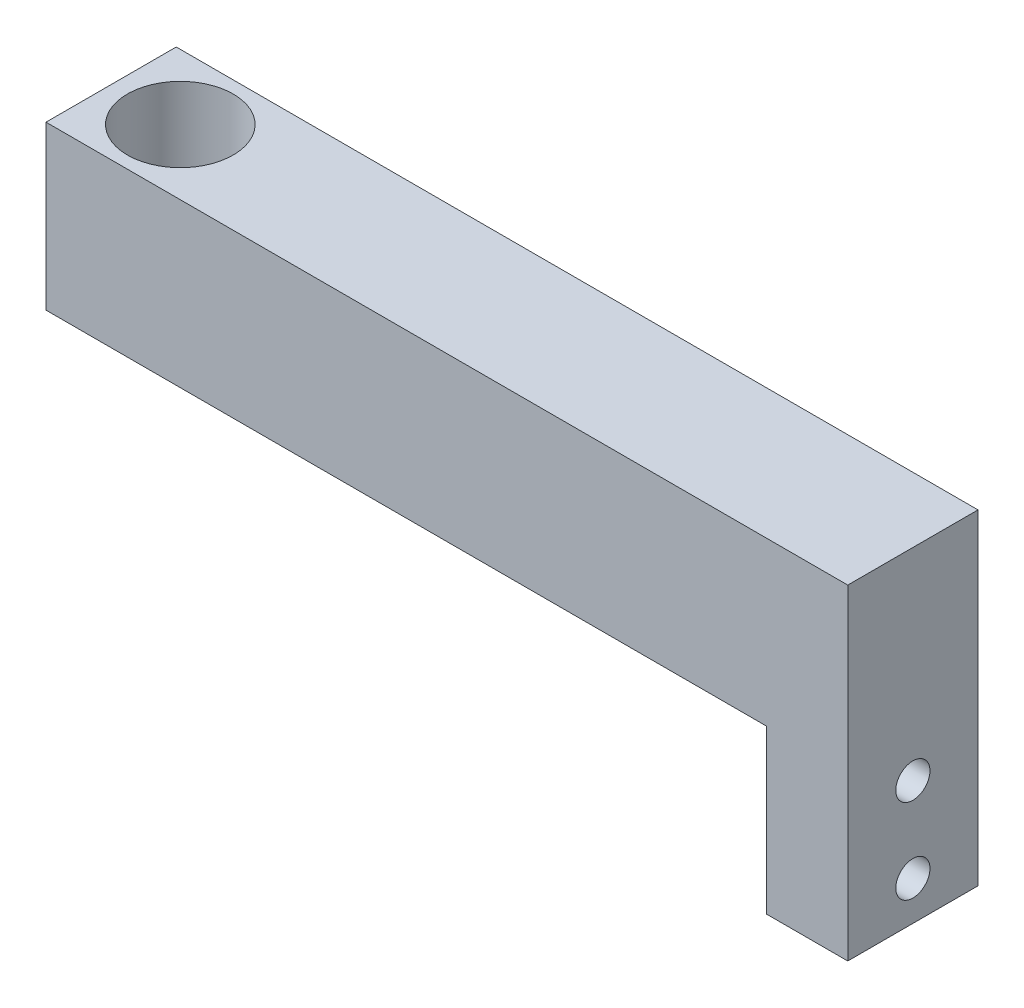
ISO-10303-21;
HEADER;
FILE_DESCRIPTION(('STEP AP214'),'2;1');
FILE_NAME('part.step','',(''),(''),'','','');
FILE_SCHEMA(('AUTOMOTIVE_DESIGN { 1 0 10303 214 1 1 1 1 }'));
ENDSEC;
DATA;
#1=APPLICATION_CONTEXT('core data for automotive mechanical design processes');
#2=APPLICATION_PROTOCOL_DEFINITION('international standard','automotive_design',2000,#1);
#3=PRODUCT_CONTEXT('',#1,'mechanical');
#4=PRODUCT('Part','Part','',(#3));
#5=PRODUCT_RELATED_PRODUCT_CATEGORY('part','',(#4));
#6=PRODUCT_DEFINITION_FORMATION('','',#4);
#7=PRODUCT_DEFINITION_CONTEXT('part definition',#1,'design');
#8=PRODUCT_DEFINITION('design','',#6,#7);
#9=PRODUCT_DEFINITION_SHAPE('','',#8);
#10=(LENGTH_UNIT() NAMED_UNIT(*) SI_UNIT(.MILLI.,.METRE.));
#11=(NAMED_UNIT(*) PLANE_ANGLE_UNIT() SI_UNIT($,.RADIAN.));
#12=(NAMED_UNIT(*) SI_UNIT($,.STERADIAN.) SOLID_ANGLE_UNIT());
#13=UNCERTAINTY_MEASURE_WITH_UNIT(LENGTH_MEASURE(1.E-05),#10,'distance_accuracy_value','');
#14=(GEOMETRIC_REPRESENTATION_CONTEXT(3) GLOBAL_UNCERTAINTY_ASSIGNED_CONTEXT((#13)) GLOBAL_UNIT_ASSIGNED_CONTEXT((#10,
#11,#12)) REPRESENTATION_CONTEXT('',''));
#15=CARTESIAN_POINT('',(0.,0.,0.));
#16=DIRECTION('',(0.,0.,1.));
#17=DIRECTION('',(1.,0.,0.));
#18=AXIS2_PLACEMENT_3D('',#15,#16,#17);
#19=CARTESIAN_POINT('',(0.,20.,0.));
#20=DIRECTION('',(0.,1.,0.));
#21=DIRECTION('',(0.,0.,1.));
#22=AXIS2_PLACEMENT_3D('',#19,#20,#21);
#23=PLANE('',#22);
#24=DIRECTION('',(0.,0.,1.));
#25=VECTOR('',#24,1.);
#26=CARTESIAN_POINT('',(-8.5,20.,-8.));
#27=LINE('',#26,#25);
#28=CARTESIAN_POINT('',(-8.5,20.,-8.));
#29=VERTEX_POINT('',#28);
#30=CARTESIAN_POINT('',(-8.5,20.,8.));
#31=VERTEX_POINT('',#30);
#32=EDGE_CURVE('E81',#29,#31,#27,.T.);
#33=ORIENTED_EDGE('',*,*,#32,.T.);
#34=DIRECTION('',(1.,0.,0.));
#35=VECTOR('',#34,1.);
#36=CARTESIAN_POINT('',(-8.5,20.,8.));
#37=LINE('',#36,#35);
#38=CARTESIAN_POINT('',(90.,20.,8.00000000000007));
#39=VERTEX_POINT('',#38);
#40=EDGE_CURVE('E147',#31,#39,#37,.T.);
#41=ORIENTED_EDGE('',*,*,#40,.T.);
#42=DIRECTION('',(0.,0.,1.));
#43=VECTOR('',#42,1.);
#44=CARTESIAN_POINT('',(90.,20.,8.00000000000007));
#45=LINE('',#44,#43);
#46=CARTESIAN_POINT('',(90.,20.,-7.99999999999993));
#47=VERTEX_POINT('',#46);
#48=EDGE_CURVE('E138',#47,#39,#45,.T.);
#49=ORIENTED_EDGE('',*,*,#48,.F.);
#50=DIRECTION('',(-1.,0.,0.));
#51=VECTOR('',#50,1.);
#52=CARTESIAN_POINT('',(-8.5,20.,-8.));
#53=LINE('',#52,#51);
#54=EDGE_CURVE('E52',#47,#29,#53,.T.);
#55=ORIENTED_EDGE('',*,*,#54,.T.);
#56=EDGE_LOOP('',(#33,#41,#49,#55));
#57=FACE_BOUND('',#56,.T.);
#58=CARTESIAN_POINT('',(0.,20.,0.));
#59=DIRECTION('',(0.,1.,0.));
#60=DIRECTION('',(0.,0.,1.));
#61=AXIS2_PLACEMENT_3D('',#58,#59,#60);
#62=CIRCLE('',#61,6.5);
#63=CARTESIAN_POINT('',(0.,20.,6.5));
#64=VERTEX_POINT('',#63);
#65=EDGE_CURVE('E90',#64,#64,#62,.T.);
#66=ORIENTED_EDGE('',*,*,#65,.F.);
#67=EDGE_LOOP('',(#66));
#68=FACE_BOUND('',#67,.T.);
#69=ADVANCED_FACE('F35',(#57,#68),#23,.T.);
#70=CARTESIAN_POINT('',(0.,0.,0.));
#71=DIRECTION('',(0.,1.,0.));
#72=DIRECTION('',(0.,0.,1.));
#73=AXIS2_PLACEMENT_3D('',#70,#71,#72);
#74=PLANE('',#73);
#75=DIRECTION('',(0.,0.,1.));
#76=VECTOR('',#75,1.);
#77=CARTESIAN_POINT('',(-8.5,0.,-8.));
#78=LINE('',#77,#76);
#79=CARTESIAN_POINT('',(-8.5,0.,-8.));
#80=VERTEX_POINT('',#79);
#81=CARTESIAN_POINT('',(-8.5,0.,8.));
#82=VERTEX_POINT('',#81);
#83=EDGE_CURVE('E87',#80,#82,#78,.T.);
#84=ORIENTED_EDGE('',*,*,#83,.F.);
#85=DIRECTION('',(-1.,0.,0.));
#86=VECTOR('',#85,1.);
#87=CARTESIAN_POINT('',(-8.5,0.,-8.));
#88=LINE('',#87,#86);
#89=CARTESIAN_POINT('',(80.,0.,-7.99999999999993));
#90=VERTEX_POINT('',#89);
#91=EDGE_CURVE('E71',#90,#80,#88,.T.);
#92=ORIENTED_EDGE('',*,*,#91,.F.);
#93=DIRECTION('',(0.,0.,-1.));
#94=VECTOR('',#93,1.);
#95=CARTESIAN_POINT('',(80.,0.,-8.));
#96=LINE('',#95,#94);
#97=CARTESIAN_POINT('',(80.,0.,8.));
#98=VERTEX_POINT('',#97);
#99=EDGE_CURVE('E82',#98,#90,#96,.T.);
#100=ORIENTED_EDGE('',*,*,#99,.F.);
#101=DIRECTION('',(1.,0.,0.));
#102=VECTOR('',#101,1.);
#103=CARTESIAN_POINT('',(-8.5,0.,8.));
#104=LINE('',#103,#102);
#105=EDGE_CURVE('E65',#82,#98,#104,.T.);
#106=ORIENTED_EDGE('',*,*,#105,.F.);
#107=EDGE_LOOP('',(#84,#92,#100,#106));
#108=FACE_BOUND('',#107,.T.);
#109=CARTESIAN_POINT('',(0.,0.,0.));
#110=DIRECTION('',(0.,1.,0.));
#111=DIRECTION('',(0.,0.,1.));
#112=AXIS2_PLACEMENT_3D('',#109,#110,#111);
#113=CIRCLE('',#112,6.5);
#114=CARTESIAN_POINT('',(0.,0.,6.5));
#115=VERTEX_POINT('',#114);
#116=EDGE_CURVE('E94',#115,#115,#113,.T.);
#117=ORIENTED_EDGE('',*,*,#116,.T.);
#118=EDGE_LOOP('',(#117));
#119=FACE_BOUND('',#118,.T.);
#120=ADVANCED_FACE('F88',(#108,#119),#74,.F.);
#121=CARTESIAN_POINT('',(-8.5,20.,-8.));
#122=DIRECTION('',(1.,0.,0.));
#123=DIRECTION('',(0.,0.,-1.));
#124=AXIS2_PLACEMENT_3D('',#121,#122,#123);
#125=PLANE('',#124);
#126=ORIENTED_EDGE('',*,*,#83,.T.);
#127=DIRECTION('',(0.,-1.,0.));
#128=VECTOR('',#127,1.);
#129=CARTESIAN_POINT('',(-8.5,20.,8.));
#130=LINE('',#129,#128);
#131=EDGE_CURVE('E11',#31,#82,#130,.T.);
#132=ORIENTED_EDGE('',*,*,#131,.F.);
#133=ORIENTED_EDGE('',*,*,#32,.F.);
#134=DIRECTION('',(0.,-1.,0.));
#135=VECTOR('',#134,1.);
#136=CARTESIAN_POINT('',(-8.5,20.,-8.));
#137=LINE('',#136,#135);
#138=EDGE_CURVE('E44',#29,#80,#137,.T.);
#139=ORIENTED_EDGE('',*,*,#138,.T.);
#140=EDGE_LOOP('',(#126,#132,#133,#139));
#141=FACE_BOUND('',#140,.T.);
#142=ADVANCED_FACE('F37',(#141),#125,.F.);
#143=CARTESIAN_POINT('',(-8.5,20.,8.));
#144=DIRECTION('',(0.,0.,-1.));
#145=DIRECTION('',(-1.,0.,0.));
#146=AXIS2_PLACEMENT_3D('',#143,#144,#145);
#147=PLANE('',#146);
#148=ORIENTED_EDGE('',*,*,#105,.T.);
#149=DIRECTION('',(0.,-1.,0.));
#150=VECTOR('',#149,1.);
#151=CARTESIAN_POINT('',(80.,20.,8.00000000000007));
#152=LINE('',#151,#150);
#153=CARTESIAN_POINT('',(80.,-20.,8.00000000000006));
#154=VERTEX_POINT('',#153);
#155=EDGE_CURVE('E104',#98,#154,#152,.T.);
#156=ORIENTED_EDGE('',*,*,#155,.T.);
#157=DIRECTION('',(-1.,0.,0.));
#158=VECTOR('',#157,1.);
#159=CARTESIAN_POINT('',(90.,-20.,8.00000000000006));
#160=LINE('',#159,#158);
#161=CARTESIAN_POINT('',(90.,-20.,8.00000000000006));
#162=VERTEX_POINT('',#161);
#163=EDGE_CURVE('E127',#162,#154,#160,.T.);
#164=ORIENTED_EDGE('',*,*,#163,.F.);
#165=DIRECTION('',(0.,-1.,0.));
#166=VECTOR('',#165,1.);
#167=CARTESIAN_POINT('',(90.,20.,8.00000000000007));
#168=LINE('',#167,#166);
#169=EDGE_CURVE('E133',#39,#162,#168,.T.);
#170=ORIENTED_EDGE('',*,*,#169,.F.);
#171=ORIENTED_EDGE('',*,*,#40,.F.);
#172=ORIENTED_EDGE('',*,*,#131,.T.);
#173=EDGE_LOOP('',(#148,#156,#164,#170,#171,#172));
#174=FACE_BOUND('',#173,.T.);
#175=ADVANCED_FACE('F140',(#174),#147,.F.);
#176=CARTESIAN_POINT('',(-8.5,20.,-8.));
#177=DIRECTION('',(0.,0.,1.));
#178=DIRECTION('',(1.,0.,0.));
#179=AXIS2_PLACEMENT_3D('',#176,#177,#178);
#180=PLANE('',#179);
#181=ORIENTED_EDGE('',*,*,#91,.T.);
#182=ORIENTED_EDGE('',*,*,#138,.F.);
#183=ORIENTED_EDGE('',*,*,#54,.F.);
#184=DIRECTION('',(0.,1.,0.));
#185=VECTOR('',#184,1.);
#186=CARTESIAN_POINT('',(90.,20.,-7.99999999999993));
#187=LINE('',#186,#185);
#188=CARTESIAN_POINT('',(90.,-20.,-7.99999999999993));
#189=VERTEX_POINT('',#188);
#190=EDGE_CURVE('E132',#189,#47,#187,.T.);
#191=ORIENTED_EDGE('',*,*,#190,.F.);
#192=DIRECTION('',(-1.,0.,0.));
#193=VECTOR('',#192,1.);
#194=CARTESIAN_POINT('',(90.,-20.,-7.99999999999993));
#195=LINE('',#194,#193);
#196=CARTESIAN_POINT('',(80.,-20.,-7.99999999999993));
#197=VERTEX_POINT('',#196);
#198=EDGE_CURVE('E128',#189,#197,#195,.T.);
#199=ORIENTED_EDGE('',*,*,#198,.T.);
#200=DIRECTION('',(0.,1.,0.));
#201=VECTOR('',#200,1.);
#202=CARTESIAN_POINT('',(80.,20.,-7.99999999999993));
#203=LINE('',#202,#201);
#204=EDGE_CURVE('E77',#197,#90,#203,.T.);
#205=ORIENTED_EDGE('',*,*,#204,.T.);
#206=EDGE_LOOP('',(#181,#182,#183,#191,#199,#205));
#207=FACE_BOUND('',#206,.T.);
#208=ADVANCED_FACE('F73',(#207),#180,.F.);
#209=CARTESIAN_POINT('',(0.,20.,0.));
#210=DIRECTION('',(0.,-1.,0.));
#211=DIRECTION('',(0.,0.,-1.));
#212=AXIS2_PLACEMENT_3D('',#209,#210,#211);
#213=CYLINDRICAL_SURFACE('',#212,6.5);
#214=ORIENTED_EDGE('',*,*,#65,.T.);
#215=EDGE_LOOP('',(#214));
#216=FACE_BOUND('',#215,.T.);
#217=ORIENTED_EDGE('',*,*,#116,.F.);
#218=EDGE_LOOP('',(#217));
#219=FACE_BOUND('',#218,.T.);
#220=ADVANCED_FACE('F173',(#216,#219),#213,.F.);
#221=CARTESIAN_POINT('',(80.,0.,0.));
#222=DIRECTION('',(1.,0.,0.));
#223=DIRECTION('',(0.,0.,-1.));
#224=AXIS2_PLACEMENT_3D('',#221,#222,#223);
#225=PLANE('',#224);
#226=CARTESIAN_POINT('',(80.,-4.8,0.));
#227=DIRECTION('',(-1.,0.,0.));
#228=DIRECTION('',(0.,0.,1.));
#229=AXIS2_PLACEMENT_3D('',#226,#227,#228);
#230=CIRCLE('',#229,2.1);
#231=CARTESIAN_POINT('',(80.,-4.8,2.1));
#232=VERTEX_POINT('',#231);
#233=EDGE_CURVE('E156',#232,#232,#230,.T.);
#234=ORIENTED_EDGE('',*,*,#233,.F.);
#235=EDGE_LOOP('',(#234));
#236=FACE_BOUND('',#235,.T.);
#237=CARTESIAN_POINT('',(80.,-15.2,0.));
#238=DIRECTION('',(-1.,0.,0.));
#239=DIRECTION('',(0.,0.,1.));
#240=AXIS2_PLACEMENT_3D('',#237,#238,#239);
#241=CIRCLE('',#240,2.1);
#242=CARTESIAN_POINT('',(80.,-15.2,2.1));
#243=VERTEX_POINT('',#242);
#244=EDGE_CURVE('E166',#243,#243,#241,.T.);
#245=ORIENTED_EDGE('',*,*,#244,.F.);
#246=EDGE_LOOP('',(#245));
#247=FACE_BOUND('',#246,.T.);
#248=ORIENTED_EDGE('',*,*,#155,.F.);
#249=ORIENTED_EDGE('',*,*,#99,.T.);
#250=ORIENTED_EDGE('',*,*,#204,.F.);
#251=DIRECTION('',(0.,0.,-1.));
#252=VECTOR('',#251,1.);
#253=CARTESIAN_POINT('',(80.,-20.,8.00000000000006));
#254=LINE('',#253,#252);
#255=EDGE_CURVE('E153',#154,#197,#254,.T.);
#256=ORIENTED_EDGE('',*,*,#255,.F.);
#257=EDGE_LOOP('',(#248,#249,#250,#256));
#258=FACE_BOUND('',#257,.T.);
#259=ADVANCED_FACE('F101',(#236,#247,#258),#225,.F.);
#260=CARTESIAN_POINT('',(90.,-20.,8.00000000000006));
#261=DIRECTION('',(0.,1.,0.));
#262=DIRECTION('',(0.,0.,1.));
#263=AXIS2_PLACEMENT_3D('',#260,#261,#262);
#264=PLANE('',#263);
#265=ORIENTED_EDGE('',*,*,#255,.T.);
#266=ORIENTED_EDGE('',*,*,#198,.F.);
#267=DIRECTION('',(0.,0.,-1.));
#268=VECTOR('',#267,1.);
#269=CARTESIAN_POINT('',(90.,-20.,8.00000000000006));
#270=LINE('',#269,#268);
#271=EDGE_CURVE('E123',#162,#189,#270,.T.);
#272=ORIENTED_EDGE('',*,*,#271,.F.);
#273=ORIENTED_EDGE('',*,*,#163,.T.);
#274=EDGE_LOOP('',(#265,#266,#272,#273));
#275=FACE_BOUND('',#274,.T.);
#276=ADVANCED_FACE('F125',(#275),#264,.F.);
#277=CARTESIAN_POINT('',(90.,0.,0.));
#278=DIRECTION('',(1.,0.,0.));
#279=DIRECTION('',(0.,0.,-1.));
#280=AXIS2_PLACEMENT_3D('',#277,#278,#279);
#281=PLANE('',#280);
#282=CARTESIAN_POINT('',(90.,-4.8,0.));
#283=DIRECTION('',(-1.,0.,0.));
#284=DIRECTION('',(0.,0.,1.));
#285=AXIS2_PLACEMENT_3D('',#282,#283,#284);
#286=CIRCLE('',#285,2.1);
#287=CARTESIAN_POINT('',(90.,-4.8,2.1));
#288=VERTEX_POINT('',#287);
#289=EDGE_CURVE('E154',#288,#288,#286,.T.);
#290=ORIENTED_EDGE('',*,*,#289,.T.);
#291=EDGE_LOOP('',(#290));
#292=FACE_BOUND('',#291,.T.);
#293=CARTESIAN_POINT('',(90.,-15.2,0.));
#294=DIRECTION('',(-1.,0.,0.));
#295=DIRECTION('',(0.,0.,1.));
#296=AXIS2_PLACEMENT_3D('',#293,#294,#295);
#297=CIRCLE('',#296,2.1);
#298=CARTESIAN_POINT('',(90.,-15.2,2.1));
#299=VERTEX_POINT('',#298);
#300=EDGE_CURVE('E161',#299,#299,#297,.T.);
#301=ORIENTED_EDGE('',*,*,#300,.T.);
#302=EDGE_LOOP('',(#301));
#303=FACE_BOUND('',#302,.T.);
#304=ORIENTED_EDGE('',*,*,#169,.T.);
#305=ORIENTED_EDGE('',*,*,#271,.T.);
#306=ORIENTED_EDGE('',*,*,#190,.T.);
#307=ORIENTED_EDGE('',*,*,#48,.T.);
#308=EDGE_LOOP('',(#304,#305,#306,#307));
#309=FACE_BOUND('',#308,.T.);
#310=ADVANCED_FACE('F137',(#292,#303,#309),#281,.T.);
#311=CARTESIAN_POINT('',(90.,-15.2,0.));
#312=DIRECTION('',(-1.,0.,0.));
#313=DIRECTION('',(0.,0.,1.));
#314=AXIS2_PLACEMENT_3D('',#311,#312,#313);
#315=CYLINDRICAL_SURFACE('',#314,2.1);
#316=ORIENTED_EDGE('',*,*,#300,.F.);
#317=EDGE_LOOP('',(#316));
#318=FACE_BOUND('',#317,.T.);
#319=ORIENTED_EDGE('',*,*,#244,.T.);
#320=EDGE_LOOP('',(#319));
#321=FACE_BOUND('',#320,.T.);
#322=ADVANCED_FACE('F170',(#318,#321),#315,.F.);
#323=CARTESIAN_POINT('',(90.,-4.8,0.));
#324=DIRECTION('',(-1.,0.,0.));
#325=DIRECTION('',(0.,0.,1.));
#326=AXIS2_PLACEMENT_3D('',#323,#324,#325);
#327=CYLINDRICAL_SURFACE('',#326,2.1);
#328=ORIENTED_EDGE('',*,*,#289,.F.);
#329=EDGE_LOOP('',(#328));
#330=FACE_BOUND('',#329,.T.);
#331=ORIENTED_EDGE('',*,*,#233,.T.);
#332=EDGE_LOOP('',(#331));
#333=FACE_BOUND('',#332,.T.);
#334=ADVANCED_FACE('F245',(#330,#333),#327,.F.);
#335=CLOSED_SHELL('',(#69,#120,#142,#175,#208,#220,#259,#276,#310,#322,#334));
#336=MANIFOLD_SOLID_BREP('B2',#335);
#337=ADVANCED_BREP_SHAPE_REPRESENTATION('',(#18,#336),#14);
#338=SHAPE_DEFINITION_REPRESENTATION(#9,#337);
ENDSEC;
END-ISO-10303-21;
